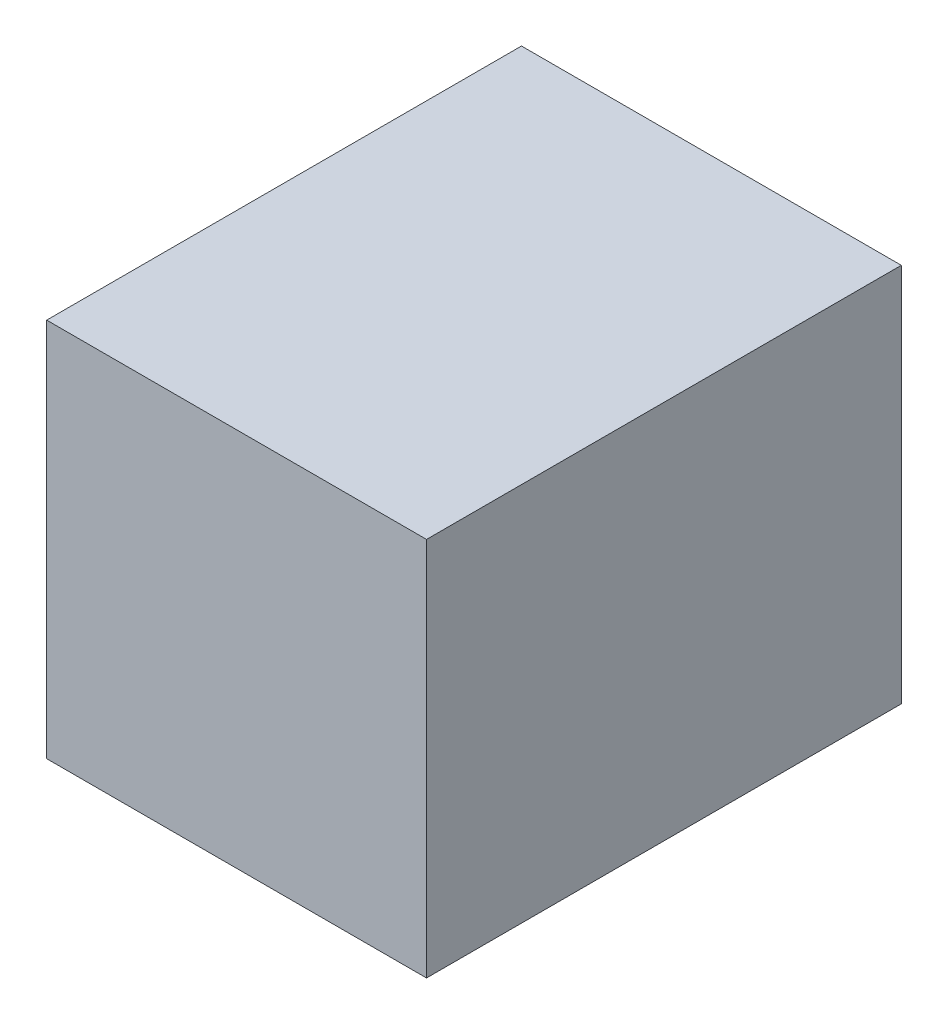
ISO-10303-21;
HEADER;
FILE_DESCRIPTION(('STEP AP214'),'2;1');
FILE_NAME('part.step','',(''),(''),'','','');
FILE_SCHEMA(('AUTOMOTIVE_DESIGN { 1 0 10303 214 1 1 1 1 }'));
ENDSEC;
DATA;
#1=APPLICATION_CONTEXT('core data for automotive mechanical design processes');
#2=APPLICATION_PROTOCOL_DEFINITION('international standard','automotive_design',2000,#1);
#3=PRODUCT_CONTEXT('',#1,'mechanical');
#4=PRODUCT('Part','Part','',(#3));
#5=PRODUCT_RELATED_PRODUCT_CATEGORY('part','',(#4));
#6=PRODUCT_DEFINITION_FORMATION('','',#4);
#7=PRODUCT_DEFINITION_CONTEXT('part definition',#1,'design');
#8=PRODUCT_DEFINITION('design','',#6,#7);
#9=PRODUCT_DEFINITION_SHAPE('','',#8);
#10=(LENGTH_UNIT() NAMED_UNIT(*) SI_UNIT(.MILLI.,.METRE.));
#11=(NAMED_UNIT(*) PLANE_ANGLE_UNIT() SI_UNIT($,.RADIAN.));
#12=(NAMED_UNIT(*) SI_UNIT($,.STERADIAN.) SOLID_ANGLE_UNIT());
#13=UNCERTAINTY_MEASURE_WITH_UNIT(LENGTH_MEASURE(1.E-05),#10,'distance_accuracy_value','');
#14=(GEOMETRIC_REPRESENTATION_CONTEXT(3) GLOBAL_UNCERTAINTY_ASSIGNED_CONTEXT((#13)) GLOBAL_UNIT_ASSIGNED_CONTEXT((#10,
#11,#12)) REPRESENTATION_CONTEXT('',''));
#15=CARTESIAN_POINT('',(0.,0.,0.));
#16=DIRECTION('',(0.,0.,1.));
#17=DIRECTION('',(1.,0.,0.));
#18=AXIS2_PLACEMENT_3D('',#15,#16,#17);
#19=CARTESIAN_POINT('',(0.4,0.8,-0.5));
#20=DIRECTION('',(-1.,0.,0.));
#21=DIRECTION('',(0.,0.,1.));
#22=AXIS2_PLACEMENT_3D('',#19,#20,#21);
#23=PLANE('',#22);
#24=DIRECTION('',(0.,0.,-1.));
#25=VECTOR('',#24,1.);
#26=CARTESIAN_POINT('',(0.4,0.,-0.5));
#27=LINE('',#26,#25);
#28=CARTESIAN_POINT('',(0.4,0.,0.5));
#29=VERTEX_POINT('',#28);
#30=CARTESIAN_POINT('',(0.4,0.,-0.5));
#31=VERTEX_POINT('',#30);
#32=EDGE_CURVE('E95',#29,#31,#27,.T.);
#33=ORIENTED_EDGE('',*,*,#32,.T.);
#34=DIRECTION('',(0.,-1.,0.));
#35=VECTOR('',#34,1.);
#36=CARTESIAN_POINT('',(0.4,0.8,-0.5));
#37=LINE('',#36,#35);
#38=CARTESIAN_POINT('',(0.4,0.8,-0.5));
#39=VERTEX_POINT('',#38);
#40=EDGE_CURVE('E11',#39,#31,#37,.T.);
#41=ORIENTED_EDGE('',*,*,#40,.F.);
#42=DIRECTION('',(0.,0.,-1.));
#43=VECTOR('',#42,1.);
#44=CARTESIAN_POINT('',(0.4,0.8,-0.5));
#45=LINE('',#44,#43);
#46=CARTESIAN_POINT('',(0.4,0.8,0.5));
#47=VERTEX_POINT('',#46);
#48=EDGE_CURVE('E83',#47,#39,#45,.T.);
#49=ORIENTED_EDGE('',*,*,#48,.F.);
#50=DIRECTION('',(0.,-1.,0.));
#51=VECTOR('',#50,1.);
#52=CARTESIAN_POINT('',(0.4,0.8,0.5));
#53=LINE('',#52,#51);
#54=EDGE_CURVE('E91',#47,#29,#53,.T.);
#55=ORIENTED_EDGE('',*,*,#54,.T.);
#56=EDGE_LOOP('',(#33,#41,#49,#55));
#57=FACE_BOUND('',#56,.T.);
#58=ADVANCED_FACE('F32',(#57),#23,.F.);
#59=CARTESIAN_POINT('',(-0.4,0.8,-0.5));
#60=DIRECTION('',(0.,0.,1.));
#61=DIRECTION('',(1.,0.,0.));
#62=AXIS2_PLACEMENT_3D('',#59,#60,#61);
#63=PLANE('',#62);
#64=DIRECTION('',(-1.,0.,0.));
#65=VECTOR('',#64,1.);
#66=CARTESIAN_POINT('',(-0.4,0.,-0.5));
#67=LINE('',#66,#65);
#68=CARTESIAN_POINT('',(-0.4,0.,-0.5));
#69=VERTEX_POINT('',#68);
#70=EDGE_CURVE('E87',#31,#69,#67,.T.);
#71=ORIENTED_EDGE('',*,*,#70,.T.);
#72=DIRECTION('',(0.,-1.,0.));
#73=VECTOR('',#72,1.);
#74=CARTESIAN_POINT('',(-0.4,0.8,-0.5));
#75=LINE('',#74,#73);
#76=CARTESIAN_POINT('',(-0.4,0.8,-0.5));
#77=VERTEX_POINT('',#76);
#78=EDGE_CURVE('E40',#77,#69,#75,.T.);
#79=ORIENTED_EDGE('',*,*,#78,.F.);
#80=DIRECTION('',(-1.,0.,0.));
#81=VECTOR('',#80,1.);
#82=CARTESIAN_POINT('',(-0.4,0.8,-0.5));
#83=LINE('',#82,#81);
#84=EDGE_CURVE('E78',#39,#77,#83,.T.);
#85=ORIENTED_EDGE('',*,*,#84,.F.);
#86=ORIENTED_EDGE('',*,*,#40,.T.);
#87=EDGE_LOOP('',(#71,#79,#85,#86));
#88=FACE_BOUND('',#87,.T.);
#89=ADVANCED_FACE('F86',(#88),#63,.F.);
#90=CARTESIAN_POINT('',(-0.4,0.8,-0.5));
#91=DIRECTION('',(1.,0.,0.));
#92=DIRECTION('',(0.,0.,-1.));
#93=AXIS2_PLACEMENT_3D('',#90,#91,#92);
#94=PLANE('',#93);
#95=DIRECTION('',(0.,0.,1.));
#96=VECTOR('',#95,1.);
#97=CARTESIAN_POINT('',(-0.4,0.,-0.5));
#98=LINE('',#97,#96);
#99=CARTESIAN_POINT('',(-0.4,0.,0.5));
#100=VERTEX_POINT('',#99);
#101=EDGE_CURVE('E65',#69,#100,#98,.T.);
#102=ORIENTED_EDGE('',*,*,#101,.T.);
#103=DIRECTION('',(0.,-1.,0.));
#104=VECTOR('',#103,1.);
#105=CARTESIAN_POINT('',(-0.4,0.8,0.5));
#106=LINE('',#105,#104);
#107=CARTESIAN_POINT('',(-0.4,0.8,0.5));
#108=VERTEX_POINT('',#107);
#109=EDGE_CURVE('E88',#108,#100,#106,.T.);
#110=ORIENTED_EDGE('',*,*,#109,.F.);
#111=DIRECTION('',(0.,0.,1.));
#112=VECTOR('',#111,1.);
#113=CARTESIAN_POINT('',(-0.4,0.8,-0.5));
#114=LINE('',#113,#112);
#115=EDGE_CURVE('E81',#77,#108,#114,.T.);
#116=ORIENTED_EDGE('',*,*,#115,.F.);
#117=ORIENTED_EDGE('',*,*,#78,.T.);
#118=EDGE_LOOP('',(#102,#110,#116,#117));
#119=FACE_BOUND('',#118,.T.);
#120=ADVANCED_FACE('F89',(#119),#94,.F.);
#121=CARTESIAN_POINT('',(-0.4,0.8,0.5));
#122=DIRECTION('',(0.,0.,-1.));
#123=DIRECTION('',(-1.,0.,0.));
#124=AXIS2_PLACEMENT_3D('',#121,#122,#123);
#125=PLANE('',#124);
#126=DIRECTION('',(1.,0.,0.));
#127=VECTOR('',#126,1.);
#128=CARTESIAN_POINT('',(-0.4,0.,0.5));
#129=LINE('',#128,#127);
#130=EDGE_CURVE('E71',#100,#29,#129,.T.);
#131=ORIENTED_EDGE('',*,*,#130,.T.);
#132=ORIENTED_EDGE('',*,*,#54,.F.);
#133=DIRECTION('',(1.,0.,0.));
#134=VECTOR('',#133,1.);
#135=CARTESIAN_POINT('',(-0.4,0.8,0.5));
#136=LINE('',#135,#134);
#137=EDGE_CURVE('E48',#108,#47,#136,.T.);
#138=ORIENTED_EDGE('',*,*,#137,.F.);
#139=ORIENTED_EDGE('',*,*,#109,.T.);
#140=EDGE_LOOP('',(#131,#132,#138,#139));
#141=FACE_BOUND('',#140,.T.);
#142=ADVANCED_FACE('F102',(#141),#125,.F.);
#143=CARTESIAN_POINT('',(0.,0.8,0.));
#144=DIRECTION('',(0.,1.,0.));
#145=DIRECTION('',(0.,0.,1.));
#146=AXIS2_PLACEMENT_3D('',#143,#144,#145);
#147=PLANE('',#146);
#148=ORIENTED_EDGE('',*,*,#48,.T.);
#149=ORIENTED_EDGE('',*,*,#84,.T.);
#150=ORIENTED_EDGE('',*,*,#115,.T.);
#151=ORIENTED_EDGE('',*,*,#137,.T.);
#152=EDGE_LOOP('',(#148,#149,#150,#151));
#153=FACE_BOUND('',#152,.T.);
#154=ADVANCED_FACE('F79',(#153),#147,.T.);
#155=CARTESIAN_POINT('',(0.,0.,0.));
#156=DIRECTION('',(0.,1.,0.));
#157=DIRECTION('',(0.,0.,1.));
#158=AXIS2_PLACEMENT_3D('',#155,#156,#157);
#159=PLANE('',#158);
#160=ORIENTED_EDGE('',*,*,#32,.F.);
#161=ORIENTED_EDGE('',*,*,#130,.F.);
#162=ORIENTED_EDGE('',*,*,#101,.F.);
#163=ORIENTED_EDGE('',*,*,#70,.F.);
#164=EDGE_LOOP('',(#160,#161,#162,#163));
#165=FACE_BOUND('',#164,.T.);
#166=ADVANCED_FACE('F105',(#165),#159,.F.);
#167=CLOSED_SHELL('',(#58,#89,#120,#142,#154,#166));
#168=MANIFOLD_SOLID_BREP('B2',#167);
#169=ADVANCED_BREP_SHAPE_REPRESENTATION('',(#18,#168),#14);
#170=SHAPE_DEFINITION_REPRESENTATION(#9,#169);
ENDSEC;
END-ISO-10303-21;
